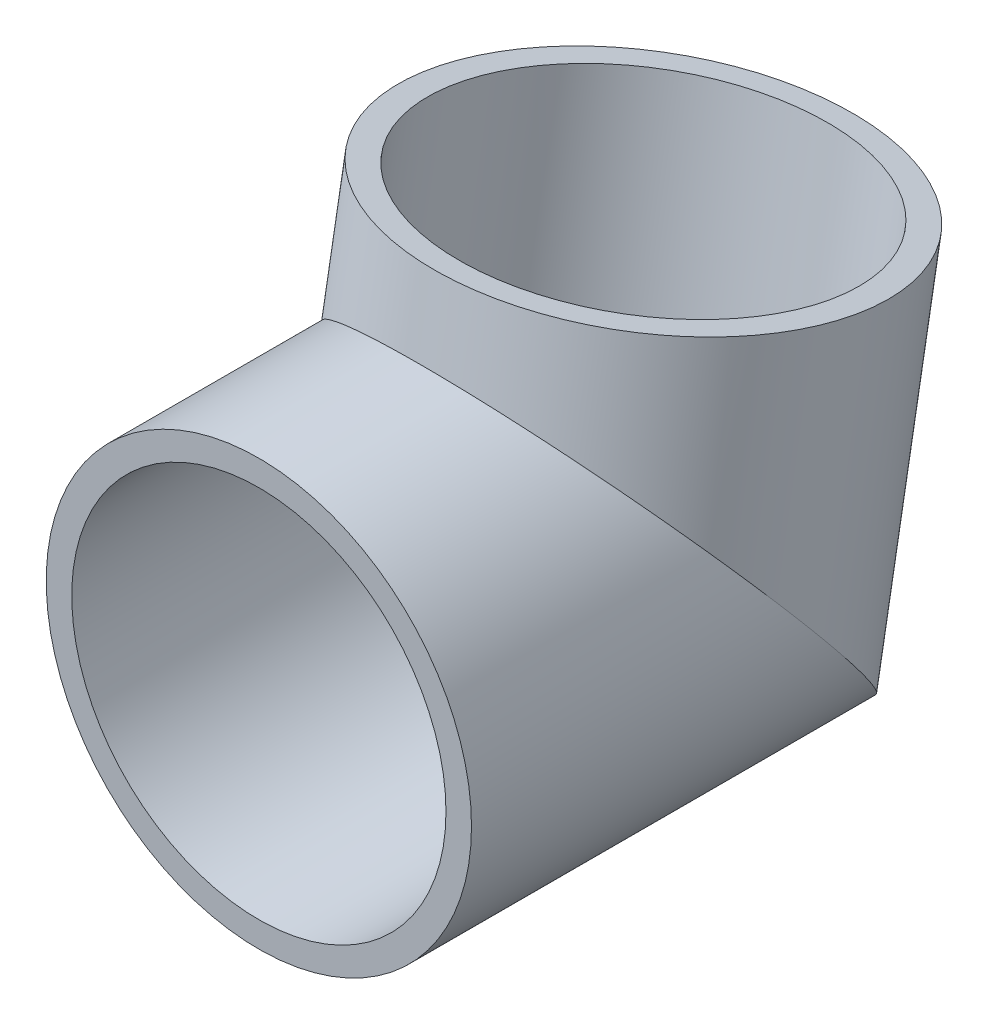
ISO-10303-21;
HEADER;
FILE_DESCRIPTION(('STEP AP214'),'2;1');
FILE_NAME('part.step','',(''),(''),'','','');
FILE_SCHEMA(('AUTOMOTIVE_DESIGN { 1 0 10303 214 1 1 1 1 }'));
ENDSEC;
DATA;
#1=APPLICATION_CONTEXT('core data for automotive mechanical design processes');
#2=APPLICATION_PROTOCOL_DEFINITION('international standard','automotive_design',2000,#1);
#3=PRODUCT_CONTEXT('',#1,'mechanical');
#4=PRODUCT('Part','Part','',(#3));
#5=PRODUCT_RELATED_PRODUCT_CATEGORY('part','',(#4));
#6=PRODUCT_DEFINITION_FORMATION('','',#4);
#7=PRODUCT_DEFINITION_CONTEXT('part definition',#1,'design');
#8=PRODUCT_DEFINITION('design','',#6,#7);
#9=PRODUCT_DEFINITION_SHAPE('','',#8);
#10=(LENGTH_UNIT() NAMED_UNIT(*) SI_UNIT(.MILLI.,.METRE.));
#11=(NAMED_UNIT(*) PLANE_ANGLE_UNIT() SI_UNIT($,.RADIAN.));
#12=(NAMED_UNIT(*) SI_UNIT($,.STERADIAN.) SOLID_ANGLE_UNIT());
#13=UNCERTAINTY_MEASURE_WITH_UNIT(LENGTH_MEASURE(1.E-05),#10,'distance_accuracy_value','');
#14=(GEOMETRIC_REPRESENTATION_CONTEXT(3) GLOBAL_UNCERTAINTY_ASSIGNED_CONTEXT((#13)) GLOBAL_UNIT_ASSIGNED_CONTEXT((#10,
#11,#12)) REPRESENTATION_CONTEXT('',''));
#15=CARTESIAN_POINT('',(0.,0.,0.));
#16=DIRECTION('',(0.,0.,1.));
#17=DIRECTION('',(1.,0.,0.));
#18=AXIS2_PLACEMENT_3D('',#15,#16,#17);
#19=CARTESIAN_POINT('',(0.,-45.5478310036202,-31.9686884813124));
#20=DIRECTION('',(0.,0.984807753012208,-0.173648177666927));
#21=DIRECTION('',(0.,0.173648177666927,0.984807753012209));
#22=AXIS2_PLACEMENT_3D('',#19,#20,#21);
#23=CYLINDRICAL_SURFACE('',#22,25.);
#24=CARTESIAN_POINT('',(0.,0.,-40.));
#25=DIRECTION('',(0.,0.64278760968654,-0.766044443118977));
#26=DIRECTION('',(0.,-0.766044443118977,-0.64278760968654));
#27=AXIS2_PLACEMENT_3D('',#24,#25,#26);
#28=ELLIPSE('',#27,32.635182233307,25.);
#29=CARTESIAN_POINT('',(0.,-25.,-60.9774907794321));
#30=VERTEX_POINT('',#29);
#31=EDGE_CURVE('E34',#30,#30,#28,.T.);
#32=ORIENTED_EDGE('',*,*,#31,.T.);
#33=EDGE_LOOP('',(#32));
#34=FACE_BOUND('',#33,.T.);
#35=CARTESIAN_POINT('',(0.,29.5442325903663,-45.2094453300078));
#36=DIRECTION('',(0.,-0.984807753012208,0.173648177666927));
#37=DIRECTION('',(1.,0.,0.));
#38=AXIS2_PLACEMENT_3D('',#35,#36,#37);
#39=CIRCLE('',#38,25.);
#40=CARTESIAN_POINT('',(25.,29.5442325903663,-45.2094453300078));
#41=VERTEX_POINT('',#40);
#42=EDGE_CURVE('E50',#41,#41,#39,.T.);
#43=ORIENTED_EDGE('',*,*,#42,.T.);
#44=EDGE_LOOP('',(#43));
#45=FACE_BOUND('',#44,.T.);
#46=ADVANCED_FACE('F31',(#34,#45),#23,.T.);
#47=CARTESIAN_POINT('',(0.,0.,0.));
#48=DIRECTION('',(0.,0.,-1.));
#49=DIRECTION('',(0.,1.,0.));
#50=AXIS2_PLACEMENT_3D('',#47,#48,#49);
#51=CYLINDRICAL_SURFACE('',#50,25.);
#52=CARTESIAN_POINT('',(0.,0.,0.));
#53=DIRECTION('',(0.,0.,1.));
#54=DIRECTION('',(1.,0.,0.));
#55=AXIS2_PLACEMENT_3D('',#52,#53,#54);
#56=CIRCLE('',#55,25.);
#57=CARTESIAN_POINT('',(25.,0.,0.));
#58=VERTEX_POINT('',#57);
#59=EDGE_CURVE('E48',#58,#58,#56,.T.);
#60=ORIENTED_EDGE('',*,*,#59,.F.);
#61=EDGE_LOOP('',(#60));
#62=FACE_BOUND('',#61,.T.);
#63=ORIENTED_EDGE('',*,*,#31,.F.);
#64=EDGE_LOOP('',(#63));
#65=FACE_BOUND('',#64,.T.);
#66=ADVANCED_FACE('F58',(#62,#65),#51,.T.);
#67=CARTESIAN_POINT('',(0.,29.5442325903663,-45.2094453300078));
#68=DIRECTION('',(0.,-0.984807753012208,0.173648177666927));
#69=DIRECTION('',(1.,0.,0.));
#70=AXIS2_PLACEMENT_3D('',#67,#68,#69);
#71=PLANE('',#70);
#72=CARTESIAN_POINT('',(0.,29.5442325903663,-45.2094453300078));
#73=DIRECTION('',(0.,-0.984807753012208,0.173648177666927));
#74=DIRECTION('',(1.,0.,0.));
#75=AXIS2_PLACEMENT_3D('',#72,#73,#74);
#76=CIRCLE('',#75,22.);
#77=CARTESIAN_POINT('',(22.,29.5442325903663,-45.2094453300078));
#78=VERTEX_POINT('',#77);
#79=EDGE_CURVE('E43',#78,#78,#76,.F.);
#80=ORIENTED_EDGE('',*,*,#79,.F.);
#81=EDGE_LOOP('',(#80));
#82=FACE_BOUND('',#81,.T.);
#83=ORIENTED_EDGE('',*,*,#42,.F.);
#84=EDGE_LOOP('',(#83));
#85=FACE_BOUND('',#84,.T.);
#86=ADVANCED_FACE('F60',(#82,#85),#71,.F.);
#87=CARTESIAN_POINT('',(0.,0.,0.));
#88=DIRECTION('',(0.,0.,1.));
#89=DIRECTION('',(1.,0.,0.));
#90=AXIS2_PLACEMENT_3D('',#87,#88,#89);
#91=PLANE('',#90);
#92=CARTESIAN_POINT('',(0.,0.,0.));
#93=DIRECTION('',(0.,0.,1.));
#94=DIRECTION('',(1.,0.,0.));
#95=AXIS2_PLACEMENT_3D('',#92,#93,#94);
#96=CIRCLE('',#95,22.);
#97=CARTESIAN_POINT('',(22.,0.,0.));
#98=VERTEX_POINT('',#97);
#99=EDGE_CURVE('E38',#98,#98,#96,.F.);
#100=ORIENTED_EDGE('',*,*,#99,.T.);
#101=EDGE_LOOP('',(#100));
#102=FACE_BOUND('',#101,.T.);
#103=ORIENTED_EDGE('',*,*,#59,.T.);
#104=EDGE_LOOP('',(#103));
#105=FACE_BOUND('',#104,.T.);
#106=ADVANCED_FACE('F66',(#102,#105),#91,.T.);
#107=CARTESIAN_POINT('',(0.,-40.0939089762219,-32.9303620854229));
#108=DIRECTION('',(0.,0.984807753012209,-0.173648177666927));
#109=DIRECTION('',(0.,0.173648177666927,0.984807753012209));
#110=AXIS2_PLACEMENT_3D('',#107,#108,#109);
#111=CYLINDRICAL_SURFACE('',#110,22.);
#112=CARTESIAN_POINT('',(0.,0.,-40.));
#113=DIRECTION('',(0.,0.64278760968654,-0.766044443118977));
#114=DIRECTION('',(0.,-0.766044443118977,-0.64278760968654));
#115=AXIS2_PLACEMENT_3D('',#112,#113,#114);
#116=ELLIPSE('',#115,28.7189603653102,22.);
#117=CARTESIAN_POINT('',(0.,-22.,-58.4601918859002));
#118=VERTEX_POINT('',#117);
#119=EDGE_CURVE('E10',#118,#118,#116,.F.);
#120=ORIENTED_EDGE('',*,*,#119,.T.);
#121=EDGE_LOOP('',(#120));
#122=FACE_BOUND('',#121,.T.);
#123=ORIENTED_EDGE('',*,*,#79,.T.);
#124=EDGE_LOOP('',(#123));
#125=FACE_BOUND('',#124,.T.);
#126=ADVANCED_FACE('F72',(#122,#125),#111,.F.);
#127=CARTESIAN_POINT('',(0.,0.,0.));
#128=DIRECTION('',(0.,0.,-1.));
#129=DIRECTION('',(0.,1.,0.));
#130=AXIS2_PLACEMENT_3D('',#127,#128,#129);
#131=CYLINDRICAL_SURFACE('',#130,22.);
#132=ORIENTED_EDGE('',*,*,#99,.F.);
#133=EDGE_LOOP('',(#132));
#134=FACE_BOUND('',#133,.T.);
#135=ORIENTED_EDGE('',*,*,#119,.F.);
#136=EDGE_LOOP('',(#135));
#137=FACE_BOUND('',#136,.T.);
#138=ADVANCED_FACE('F70',(#134,#137),#131,.F.);
#139=CLOSED_SHELL('',(#46,#66,#86,#106,#126,#138));
#140=MANIFOLD_SOLID_BREP('B2',#139);
#141=ADVANCED_BREP_SHAPE_REPRESENTATION('',(#18,#140),#14);
#142=SHAPE_DEFINITION_REPRESENTATION(#9,#141);
ENDSEC;
END-ISO-10303-21;
